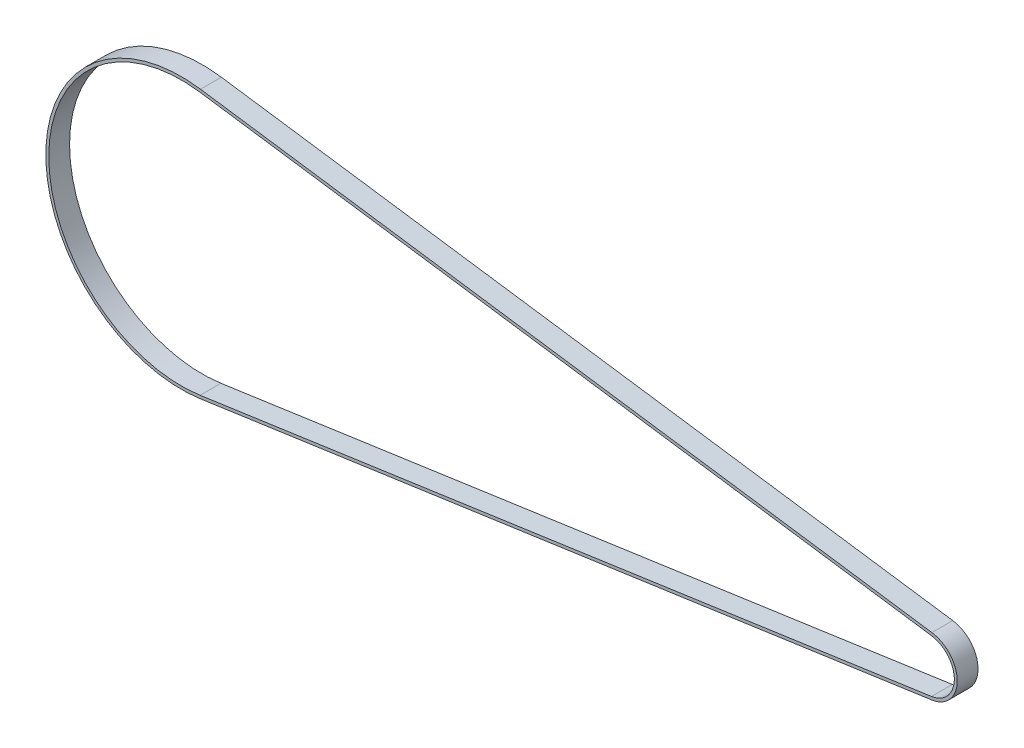
ISO-10303-21;
HEADER;
FILE_DESCRIPTION(('STEP AP214'),'2;1');
FILE_NAME('part.step','',(''),(''),'','','');
FILE_SCHEMA(('AUTOMOTIVE_DESIGN { 1 0 10303 214 1 1 1 1 }'));
ENDSEC;
DATA;
#1=APPLICATION_CONTEXT('core data for automotive mechanical design processes');
#2=APPLICATION_PROTOCOL_DEFINITION('international standard','automotive_design',2000,#1);
#3=PRODUCT_CONTEXT('',#1,'mechanical');
#4=PRODUCT('Part','Part','',(#3));
#5=PRODUCT_RELATED_PRODUCT_CATEGORY('part','',(#4));
#6=PRODUCT_DEFINITION_FORMATION('','',#4);
#7=PRODUCT_DEFINITION_CONTEXT('part definition',#1,'design');
#8=PRODUCT_DEFINITION('design','',#6,#7);
#9=PRODUCT_DEFINITION_SHAPE('','',#8);
#10=(LENGTH_UNIT() NAMED_UNIT(*) SI_UNIT(.MILLI.,.METRE.));
#11=(NAMED_UNIT(*) PLANE_ANGLE_UNIT() SI_UNIT($,.RADIAN.));
#12=(NAMED_UNIT(*) SI_UNIT($,.STERADIAN.) SOLID_ANGLE_UNIT());
#13=UNCERTAINTY_MEASURE_WITH_UNIT(LENGTH_MEASURE(1.E-05),#10,'distance_accuracy_value','');
#14=(GEOMETRIC_REPRESENTATION_CONTEXT(3) GLOBAL_UNCERTAINTY_ASSIGNED_CONTEXT((#13)) GLOBAL_UNIT_ASSIGNED_CONTEXT((#10,
#11,#12)) REPRESENTATION_CONTEXT('',''));
#15=CARTESIAN_POINT('',(0.,0.,0.));
#16=DIRECTION('',(0.,0.,1.));
#17=DIRECTION('',(1.,0.,0.));
#18=AXIS2_PLACEMENT_3D('',#15,#16,#17);
#19=CARTESIAN_POINT('',(-2.45914399954472E-11,1.0769163338864E-11,-14.224));
#20=DIRECTION('',(0.,0.,1.));
#21=DIRECTION('',(1.,0.,0.));
#22=AXIS2_PLACEMENT_3D('',#19,#20,#21);
#23=CYLINDRICAL_SURFACE('',#22,20.161);
#24=CARTESIAN_POINT('',(-2.45914399954472E-11,1.0769163338864E-11,0.));
#25=DIRECTION('',(0.,0.,-1.));
#26=DIRECTION('',(-1.,0.,0.));
#27=AXIS2_PLACEMENT_3D('',#24,#25,#26);
#28=CIRCLE('',#27,20.161);
#29=CARTESIAN_POINT('',(2.86167605879988,-19.9568717772581,0.));
#30=VERTEX_POINT('',#29);
#31=CARTESIAN_POINT('',(2.86167605879817,19.9568717772799,0.));
#32=VERTEX_POINT('',#31);
#33=EDGE_CURVE('E157',#30,#32,#28,.F.);
#34=ORIENTED_EDGE('',*,*,#33,.F.);
#35=DIRECTION('',(0.,0.,1.));
#36=VECTOR('',#35,1.);
#37=CARTESIAN_POINT('',(2.86167605879988,-19.9568717772581,-14.224));
#38=LINE('',#37,#36);
#39=CARTESIAN_POINT('',(2.86167605879988,-19.9568717772581,-14.224));
#40=VERTEX_POINT('',#39);
#41=EDGE_CURVE('E12',#40,#30,#38,.T.);
#42=ORIENTED_EDGE('',*,*,#41,.F.);
#43=CARTESIAN_POINT('',(-2.45914399954472E-11,1.0769163338864E-11,-14.224));
#44=DIRECTION('',(0.,0.,-1.));
#45=DIRECTION('',(-1.,0.,0.));
#46=AXIS2_PLACEMENT_3D('',#43,#44,#45);
#47=CIRCLE('',#46,20.161);
#48=CARTESIAN_POINT('',(2.86167605879817,19.9568717772799,-14.224));
#49=VERTEX_POINT('',#48);
#50=EDGE_CURVE('E161',#40,#49,#47,.F.);
#51=ORIENTED_EDGE('',*,*,#50,.T.);
#52=DIRECTION('',(0.,0.,1.));
#53=VECTOR('',#52,1.);
#54=CARTESIAN_POINT('',(2.86167605879817,19.9568717772799,-14.224));
#55=LINE('',#54,#53);
#56=EDGE_CURVE('E62',#49,#32,#55,.T.);
#57=ORIENTED_EDGE('',*,*,#56,.T.);
#58=EDGE_LOOP('',(#34,#42,#51,#57));
#59=FACE_BOUND('',#58,.T.);
#60=ADVANCED_FACE('F59',(#59),#23,.T.);
#61=CARTESIAN_POINT('',(2.86167605879989,-19.9568717772581,-14.224));
#62=DIRECTION('',(0.141941176470635,-0.989875094353895,0.));
#63=DIRECTION('',(0.989875094353895,0.141941176470635,0.));
#64=AXIS2_PLACEMENT_3D('',#61,#62,#63);
#65=PLANE('',#64);
#66=DIRECTION('',(0.989875094353895,0.141941176470635,0.));
#67=VECTOR('',#66,1.);
#68=CARTESIAN_POINT('',(2.86167605879989,-19.9568717772581,0.));
#69=LINE('',#68,#67);
#70=CARTESIAN_POINT('',(-496.863202176481,-91.6139298575593,0.));
#71=VERTEX_POINT('',#70);
#72=EDGE_CURVE('E165',#71,#30,#69,.T.);
#73=ORIENTED_EDGE('',*,*,#72,.F.);
#74=DIRECTION('',(0.,0.,1.));
#75=VECTOR('',#74,1.);
#76=CARTESIAN_POINT('',(-496.863202176481,-91.6139298575593,-14.224));
#77=LINE('',#76,#75);
#78=CARTESIAN_POINT('',(-496.863202176481,-91.6139298575593,-14.224));
#79=VERTEX_POINT('',#78);
#80=EDGE_CURVE('E67',#79,#71,#77,.T.);
#81=ORIENTED_EDGE('',*,*,#80,.F.);
#82=DIRECTION('',(0.989875094353895,0.141941176470635,0.));
#83=VECTOR('',#82,1.);
#84=CARTESIAN_POINT('',(2.86167605879989,-19.9568717772581,-14.224));
#85=LINE('',#84,#83);
#86=EDGE_CURVE('E171',#79,#40,#85,.T.);
#87=ORIENTED_EDGE('',*,*,#86,.T.);
#88=ORIENTED_EDGE('',*,*,#41,.T.);
#89=EDGE_LOOP('',(#73,#81,#87,#88));
#90=FACE_BOUND('',#89,.T.);
#91=ADVANCED_FACE('F197',(#90),#65,.T.);
#92=CARTESIAN_POINT('',(-510.000000000015,-1.19904086659517E-11,-14.224));
#93=DIRECTION('',(0.,0.,1.));
#94=DIRECTION('',(1.,0.,0.));
#95=AXIS2_PLACEMENT_3D('',#92,#93,#94);
#96=CYLINDRICAL_SURFACE('',#95,92.551);
#97=CARTESIAN_POINT('',(-510.000000000015,-1.19904086659517E-11,0.));
#98=DIRECTION('',(0.,0.,-1.));
#99=DIRECTION('',(-1.,0.,0.));
#100=AXIS2_PLACEMENT_3D('',#97,#98,#99);
#101=CIRCLE('',#100,92.551);
#102=CARTESIAN_POINT('',(-496.863202176489,91.6139298575365,0.));
#103=VERTEX_POINT('',#102);
#104=EDGE_CURVE('E179',#103,#71,#101,.F.);
#105=ORIENTED_EDGE('',*,*,#104,.F.);
#106=DIRECTION('',(0.,0.,1.));
#107=VECTOR('',#106,1.);
#108=CARTESIAN_POINT('',(-496.863202176489,91.6139298575365,-14.224));
#109=LINE('',#108,#107);
#110=CARTESIAN_POINT('',(-496.863202176489,91.6139298575365,-14.224));
#111=VERTEX_POINT('',#110);
#112=EDGE_CURVE('E184',#111,#103,#109,.T.);
#113=ORIENTED_EDGE('',*,*,#112,.F.);
#114=CARTESIAN_POINT('',(-510.000000000015,-1.19904086659517E-11,-14.224));
#115=DIRECTION('',(0.,0.,-1.));
#116=DIRECTION('',(-1.,0.,0.));
#117=AXIS2_PLACEMENT_3D('',#114,#115,#116);
#118=CIRCLE('',#117,92.551);
#119=EDGE_CURVE('E168',#111,#79,#118,.F.);
#120=ORIENTED_EDGE('',*,*,#119,.T.);
#121=ORIENTED_EDGE('',*,*,#80,.T.);
#122=EDGE_LOOP('',(#105,#113,#120,#121));
#123=FACE_BOUND('',#122,.T.);
#124=ADVANCED_FACE('F201',(#123),#96,.T.);
#125=CARTESIAN_POINT('',(2.8616760587981,19.9568717772799,-14.224));
#126=DIRECTION('',(0.141941176470547,0.989875094353907,0.));
#127=DIRECTION('',(-0.989875094353908,0.141941176470547,0.));
#128=AXIS2_PLACEMENT_3D('',#125,#126,#127);
#129=PLANE('',#128);
#130=DIRECTION('',(-0.989875094353907,0.141941176470547,0.));
#131=VECTOR('',#130,1.);
#132=CARTESIAN_POINT('',(2.8616760587981,19.9568717772799,0.));
#133=LINE('',#132,#131);
#134=EDGE_CURVE('E176',#32,#103,#133,.T.);
#135=ORIENTED_EDGE('',*,*,#134,.F.);
#136=ORIENTED_EDGE('',*,*,#56,.F.);
#137=DIRECTION('',(-0.989875094353907,0.141941176470547,0.));
#138=VECTOR('',#137,1.);
#139=CARTESIAN_POINT('',(2.8616760587981,19.9568717772799,-14.224));
#140=LINE('',#139,#138);
#141=EDGE_CURVE('E164',#49,#111,#140,.T.);
#142=ORIENTED_EDGE('',*,*,#141,.T.);
#143=ORIENTED_EDGE('',*,*,#112,.T.);
#144=EDGE_LOOP('',(#135,#136,#142,#143));
#145=FACE_BOUND('',#144,.T.);
#146=ADVANCED_FACE('F192',(#145),#129,.T.);
#147=CARTESIAN_POINT('',(-2.45914399954472E-11,1.0769163338864E-11,-14.224));
#148=DIRECTION('',(0.,0.,-1.));
#149=DIRECTION('',(-1.,0.,0.));
#150=AXIS2_PLACEMENT_3D('',#147,#148,#149);
#151=PLANE('',#150);
#152=CARTESIAN_POINT('',(-2.45914399954472E-11,1.0769163338864E-11,-14.224));
#153=DIRECTION('',(0.,0.,1.));
#154=DIRECTION('',(-1.,0.,0.));
#155=AXIS2_PLACEMENT_3D('',#152,#153,#154);
#156=CIRCLE('',#155,18.161);
#157=CARTESIAN_POINT('',(2.57779370585861,-17.9771215885503,-14.224));
#158=VERTEX_POINT('',#157);
#159=CARTESIAN_POINT('',(2.57779370585701,17.9771215885721,-14.224));
#160=VERTEX_POINT('',#159);
#161=EDGE_CURVE('E126',#158,#160,#156,.T.);
#162=ORIENTED_EDGE('',*,*,#161,.T.);
#163=DIRECTION('',(-0.989875094353907,0.141941176470547,0.));
#164=VECTOR('',#163,1.);
#165=CARTESIAN_POINT('',(-497.14708452943,89.6341796688287,-14.224));
#166=LINE('',#165,#164);
#167=CARTESIAN_POINT('',(-497.14708452943,89.6341796688287,-14.224));
#168=VERTEX_POINT('',#167);
#169=EDGE_CURVE('E135',#160,#168,#166,.T.);
#170=ORIENTED_EDGE('',*,*,#169,.T.);
#171=CARTESIAN_POINT('',(-510.000000000015,-1.19904086659517E-11,-14.224));
#172=DIRECTION('',(0.,0.,1.));
#173=DIRECTION('',(-1.,0.,0.));
#174=AXIS2_PLACEMENT_3D('',#171,#172,#173);
#175=CIRCLE('',#174,90.551);
#176=CARTESIAN_POINT('',(-497.147084529422,-89.6341796688515,-14.224));
#177=VERTEX_POINT('',#176);
#178=EDGE_CURVE('E75',#168,#177,#175,.T.);
#179=ORIENTED_EDGE('',*,*,#178,.T.);
#180=DIRECTION('',(0.989875094353895,0.141941176470635,0.));
#181=VECTOR('',#180,1.);
#182=CARTESIAN_POINT('',(2.57779370585861,-17.9771215885503,-14.224));
#183=LINE('',#182,#181);
#184=EDGE_CURVE('E132',#177,#158,#183,.T.);
#185=ORIENTED_EDGE('',*,*,#184,.T.);
#186=EDGE_LOOP('',(#162,#170,#179,#185));
#187=FACE_BOUND('',#186,.T.);
#188=ORIENTED_EDGE('',*,*,#50,.F.);
#189=ORIENTED_EDGE('',*,*,#86,.F.);
#190=ORIENTED_EDGE('',*,*,#119,.F.);
#191=ORIENTED_EDGE('',*,*,#141,.F.);
#192=EDGE_LOOP('',(#188,#189,#190,#191));
#193=FACE_BOUND('',#192,.T.);
#194=ADVANCED_FACE('F139',(#187,#193),#151,.T.);
#195=CARTESIAN_POINT('',(-2.45914399954472E-11,1.0769163338864E-11,0.));
#196=DIRECTION('',(0.,0.,-1.));
#197=DIRECTION('',(-1.,0.,0.));
#198=AXIS2_PLACEMENT_3D('',#195,#196,#197);
#199=PLANE('',#198);
#200=DIRECTION('',(-0.989875094353907,0.141941176470547,0.));
#201=VECTOR('',#200,1.);
#202=CARTESIAN_POINT('',(-497.14708452943,89.6341796688287,0.));
#203=LINE('',#202,#201);
#204=CARTESIAN_POINT('',(2.57779370585701,17.9771215885721,0.));
#205=VERTEX_POINT('',#204);
#206=CARTESIAN_POINT('',(-497.14708452943,89.6341796688287,0.));
#207=VERTEX_POINT('',#206);
#208=EDGE_CURVE('E151',#205,#207,#203,.T.);
#209=ORIENTED_EDGE('',*,*,#208,.F.);
#210=CARTESIAN_POINT('',(-2.45914399954472E-11,1.0769163338864E-11,0.));
#211=DIRECTION('',(0.,0.,1.));
#212=DIRECTION('',(-1.,0.,0.));
#213=AXIS2_PLACEMENT_3D('',#210,#211,#212);
#214=CIRCLE('',#213,18.161);
#215=CARTESIAN_POINT('',(2.57779370585861,-17.9771215885503,0.));
#216=VERTEX_POINT('',#215);
#217=EDGE_CURVE('E83',#216,#205,#214,.T.);
#218=ORIENTED_EDGE('',*,*,#217,.F.);
#219=DIRECTION('',(0.989875094353895,0.141941176470635,0.));
#220=VECTOR('',#219,1.);
#221=CARTESIAN_POINT('',(2.57779370585861,-17.9771215885503,0.));
#222=LINE('',#221,#220);
#223=CARTESIAN_POINT('',(-497.147084529422,-89.6341796688515,0.));
#224=VERTEX_POINT('',#223);
#225=EDGE_CURVE('E142',#224,#216,#222,.T.);
#226=ORIENTED_EDGE('',*,*,#225,.F.);
#227=CARTESIAN_POINT('',(-510.000000000015,-1.19904086659517E-11,0.));
#228=DIRECTION('',(0.,0.,1.));
#229=DIRECTION('',(-1.,0.,0.));
#230=AXIS2_PLACEMENT_3D('',#227,#228,#229);
#231=CIRCLE('',#230,90.551);
#232=EDGE_CURVE('E145',#207,#224,#231,.T.);
#233=ORIENTED_EDGE('',*,*,#232,.F.);
#234=EDGE_LOOP('',(#209,#218,#226,#233));
#235=FACE_BOUND('',#234,.T.);
#236=ORIENTED_EDGE('',*,*,#33,.T.);
#237=ORIENTED_EDGE('',*,*,#134,.T.);
#238=ORIENTED_EDGE('',*,*,#104,.T.);
#239=ORIENTED_EDGE('',*,*,#72,.T.);
#240=EDGE_LOOP('',(#236,#237,#238,#239));
#241=FACE_BOUND('',#240,.T.);
#242=ADVANCED_FACE('F194',(#235,#241),#199,.F.);
#243=CARTESIAN_POINT('',(-2.45914399954472E-11,1.0769163338864E-11,-14.224));
#244=DIRECTION('',(0.,0.,1.));
#245=DIRECTION('',(1.,0.,0.));
#246=AXIS2_PLACEMENT_3D('',#243,#244,#245);
#247=CYLINDRICAL_SURFACE('',#246,18.161);
#248=ORIENTED_EDGE('',*,*,#217,.T.);
#249=DIRECTION('',(0.,0.,1.));
#250=VECTOR('',#249,1.);
#251=CARTESIAN_POINT('',(2.57779370585701,17.9771215885721,-14.224));
#252=LINE('',#251,#250);
#253=EDGE_CURVE('E122',#160,#205,#252,.T.);
#254=ORIENTED_EDGE('',*,*,#253,.F.);
#255=ORIENTED_EDGE('',*,*,#161,.F.);
#256=DIRECTION('',(0.,0.,1.));
#257=VECTOR('',#256,1.);
#258=CARTESIAN_POINT('',(2.57779370585861,-17.9771215885503,-14.224));
#259=LINE('',#258,#257);
#260=EDGE_CURVE('E155',#158,#216,#259,.T.);
#261=ORIENTED_EDGE('',*,*,#260,.T.);
#262=EDGE_LOOP('',(#248,#254,#255,#261));
#263=FACE_BOUND('',#262,.T.);
#264=ADVANCED_FACE('F124',(#263),#247,.F.);
#265=CARTESIAN_POINT('',(2.57779370585861,-17.9771215885503,-14.224));
#266=DIRECTION('',(0.141941176470635,-0.989875094353895,0.));
#267=DIRECTION('',(0.989875094353895,0.141941176470635,0.));
#268=AXIS2_PLACEMENT_3D('',#265,#266,#267);
#269=PLANE('',#268);
#270=ORIENTED_EDGE('',*,*,#225,.T.);
#271=ORIENTED_EDGE('',*,*,#260,.F.);
#272=ORIENTED_EDGE('',*,*,#184,.F.);
#273=DIRECTION('',(0.,0.,1.));
#274=VECTOR('',#273,1.);
#275=CARTESIAN_POINT('',(-497.147084529422,-89.6341796688515,-14.224));
#276=LINE('',#275,#274);
#277=EDGE_CURVE('E158',#177,#224,#276,.T.);
#278=ORIENTED_EDGE('',*,*,#277,.T.);
#279=EDGE_LOOP('',(#270,#271,#272,#278));
#280=FACE_BOUND('',#279,.T.);
#281=ADVANCED_FACE('F252',(#280),#269,.F.);
#282=CARTESIAN_POINT('',(-510.000000000015,-1.19904086659517E-11,-14.224));
#283=DIRECTION('',(0.,0.,1.));
#284=DIRECTION('',(1.,0.,0.));
#285=AXIS2_PLACEMENT_3D('',#282,#283,#284);
#286=CYLINDRICAL_SURFACE('',#285,90.551);
#287=ORIENTED_EDGE('',*,*,#232,.T.);
#288=ORIENTED_EDGE('',*,*,#277,.F.);
#289=ORIENTED_EDGE('',*,*,#178,.F.);
#290=DIRECTION('',(0.,0.,1.));
#291=VECTOR('',#290,1.);
#292=CARTESIAN_POINT('',(-497.14708452943,89.6341796688287,-14.224));
#293=LINE('',#292,#291);
#294=EDGE_CURVE('E131',#168,#207,#293,.T.);
#295=ORIENTED_EDGE('',*,*,#294,.T.);
#296=EDGE_LOOP('',(#287,#288,#289,#295));
#297=FACE_BOUND('',#296,.T.);
#298=ADVANCED_FACE('F261',(#297),#286,.F.);
#299=CARTESIAN_POINT('',(-497.14708452943,89.6341796688287,-14.224));
#300=DIRECTION('',(0.141941176470547,0.989875094353907,0.));
#301=DIRECTION('',(-0.989875094353907,0.141941176470547,0.));
#302=AXIS2_PLACEMENT_3D('',#299,#300,#301);
#303=PLANE('',#302);
#304=ORIENTED_EDGE('',*,*,#208,.T.);
#305=ORIENTED_EDGE('',*,*,#294,.F.);
#306=ORIENTED_EDGE('',*,*,#169,.F.);
#307=ORIENTED_EDGE('',*,*,#253,.T.);
#308=EDGE_LOOP('',(#304,#305,#306,#307));
#309=FACE_BOUND('',#308,.T.);
#310=ADVANCED_FACE('F136',(#309),#303,.F.);
#311=CLOSED_SHELL('',(#60,#91,#124,#146,#194,#242,#264,#281,#298,#310));
#312=MANIFOLD_SOLID_BREP('B2',#311);
#313=ADVANCED_BREP_SHAPE_REPRESENTATION('',(#18,#312),#14);
#314=SHAPE_DEFINITION_REPRESENTATION(#9,#313);
ENDSEC;
END-ISO-10303-21;
